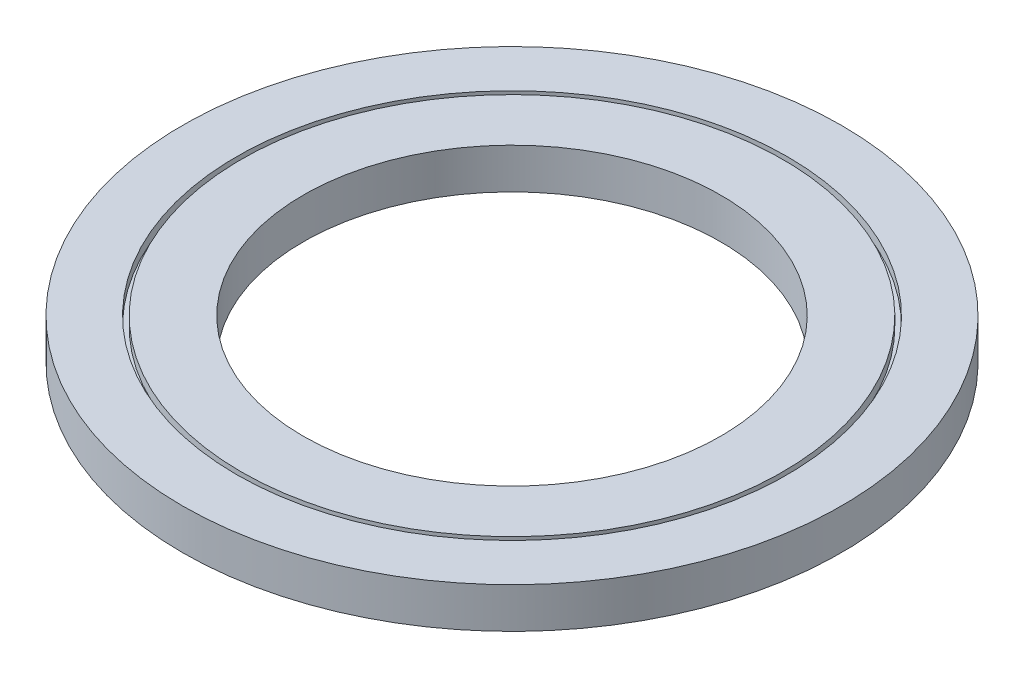
ISO-10303-21;
HEADER;
FILE_DESCRIPTION(('STEP AP214'),'2;1');
FILE_NAME('part.step','',(''),(''),'','','');
FILE_SCHEMA(('AUTOMOTIVE_DESIGN { 1 0 10303 214 1 1 1 1 }'));
ENDSEC;
DATA;
#1=APPLICATION_CONTEXT('core data for automotive mechanical design processes');
#2=APPLICATION_PROTOCOL_DEFINITION('international standard','automotive_design',2000,#1);
#3=PRODUCT_CONTEXT('',#1,'mechanical');
#4=PRODUCT('Part','Part','',(#3));
#5=PRODUCT_RELATED_PRODUCT_CATEGORY('part','',(#4));
#6=PRODUCT_DEFINITION_FORMATION('','',#4);
#7=PRODUCT_DEFINITION_CONTEXT('part definition',#1,'design');
#8=PRODUCT_DEFINITION('design','',#6,#7);
#9=PRODUCT_DEFINITION_SHAPE('','',#8);
#10=(LENGTH_UNIT() NAMED_UNIT(*) SI_UNIT(.MILLI.,.METRE.));
#11=(NAMED_UNIT(*) PLANE_ANGLE_UNIT() SI_UNIT($,.RADIAN.));
#12=(NAMED_UNIT(*) SI_UNIT($,.STERADIAN.) SOLID_ANGLE_UNIT());
#13=UNCERTAINTY_MEASURE_WITH_UNIT(LENGTH_MEASURE(1.E-05),#10,'distance_accuracy_value','');
#14=(GEOMETRIC_REPRESENTATION_CONTEXT(3) GLOBAL_UNCERTAINTY_ASSIGNED_CONTEXT((#13)) GLOBAL_UNIT_ASSIGNED_CONTEXT((#10,
#11,#12)) REPRESENTATION_CONTEXT('',''));
#15=CARTESIAN_POINT('',(0.,0.,0.));
#16=DIRECTION('',(0.,0.,1.));
#17=DIRECTION('',(1.,0.,0.));
#18=AXIS2_PLACEMENT_3D('',#15,#16,#17);
#19=CARTESIAN_POINT('',(0.,8.6,0.));
#20=DIRECTION('',(0.,1.,0.));
#21=DIRECTION('',(0.,0.,1.));
#22=AXIS2_PLACEMENT_3D('',#19,#20,#21);
#23=PLANE('',#22);
#24=CARTESIAN_POINT('',(0.,8.6,0.));
#25=DIRECTION('',(0.,1.,0.));
#26=DIRECTION('',(0.,0.,1.));
#27=AXIS2_PLACEMENT_3D('',#24,#25,#26);
#28=CIRCLE('',#27,44.35);
#29=CARTESIAN_POINT('',(0.,8.6,44.35));
#30=VERTEX_POINT('',#29);
#31=EDGE_CURVE('E56',#30,#30,#28,.T.);
#32=ORIENTED_EDGE('',*,*,#31,.F.);
#33=EDGE_LOOP('',(#32));
#34=FACE_BOUND('',#33,.T.);
#35=CARTESIAN_POINT('',(0.,8.6,0.));
#36=DIRECTION('',(0.,1.,0.));
#37=DIRECTION('',(0.,0.,1.));
#38=AXIS2_PLACEMENT_3D('',#35,#36,#37);
#39=CIRCLE('',#38,57.5);
#40=CARTESIAN_POINT('',(0.,8.6,57.5));
#41=VERTEX_POINT('',#40);
#42=EDGE_CURVE('E74',#41,#41,#39,.T.);
#43=ORIENTED_EDGE('',*,*,#42,.T.);
#44=EDGE_LOOP('',(#43));
#45=FACE_BOUND('',#44,.T.);
#46=ADVANCED_FACE('F43',(#34,#45),#23,.T.);
#47=CARTESIAN_POINT('',(0.,8.6,0.));
#48=DIRECTION('',(0.,1.,0.));
#49=DIRECTION('',(0.,0.,1.));
#50=AXIS2_PLACEMENT_3D('',#47,#48,#49);
#51=CIRCLE('',#50,58.5);
#52=CARTESIAN_POINT('',(0.,8.6,58.5));
#53=VERTEX_POINT('',#52);
#54=EDGE_CURVE('E66',#53,#53,#51,.T.);
#55=ORIENTED_EDGE('',*,*,#54,.F.);
#56=EDGE_LOOP('',(#55));
#57=FACE_BOUND('',#56,.T.);
#58=CARTESIAN_POINT('',(0.,8.6,0.));
#59=DIRECTION('',(0.,1.,0.));
#60=DIRECTION('',(0.,0.,1.));
#61=AXIS2_PLACEMENT_3D('',#58,#59,#60);
#62=CIRCLE('',#61,70.);
#63=CARTESIAN_POINT('',(0.,8.6,70.));
#64=VERTEX_POINT('',#63);
#65=EDGE_CURVE('E10',#64,#64,#62,.T.);
#66=ORIENTED_EDGE('',*,*,#65,.T.);
#67=EDGE_LOOP('',(#66));
#68=FACE_BOUND('',#67,.T.);
#69=ADVANCED_FACE('F98',(#57,#68),#23,.T.);
#70=CARTESIAN_POINT('',(0.,0.,0.));
#71=DIRECTION('',(0.,1.,0.));
#72=DIRECTION('',(0.,0.,1.));
#73=AXIS2_PLACEMENT_3D('',#70,#71,#72);
#74=PLANE('',#73);
#75=CARTESIAN_POINT('',(0.,0.,0.));
#76=DIRECTION('',(0.,1.,0.));
#77=DIRECTION('',(0.,0.,1.));
#78=AXIS2_PLACEMENT_3D('',#75,#76,#77);
#79=CIRCLE('',#78,70.);
#80=CARTESIAN_POINT('',(0.,0.,70.));
#81=VERTEX_POINT('',#80);
#82=EDGE_CURVE('E47',#81,#81,#79,.T.);
#83=ORIENTED_EDGE('',*,*,#82,.F.);
#84=EDGE_LOOP('',(#83));
#85=FACE_BOUND('',#84,.T.);
#86=CARTESIAN_POINT('',(0.,0.,0.));
#87=DIRECTION('',(0.,1.,0.));
#88=DIRECTION('',(0.,0.,1.));
#89=AXIS2_PLACEMENT_3D('',#86,#87,#88);
#90=CIRCLE('',#89,44.35);
#91=CARTESIAN_POINT('',(0.,0.,44.35));
#92=VERTEX_POINT('',#91);
#93=EDGE_CURVE('E58',#92,#92,#90,.T.);
#94=ORIENTED_EDGE('',*,*,#93,.T.);
#95=EDGE_LOOP('',(#94));
#96=FACE_BOUND('',#95,.T.);
#97=ADVANCED_FACE('F100',(#85,#96),#74,.F.);
#98=CARTESIAN_POINT('',(0.,8.6,0.));
#99=DIRECTION('',(0.,-1.,0.));
#100=DIRECTION('',(0.,0.,-1.));
#101=AXIS2_PLACEMENT_3D('',#98,#99,#100);
#102=CYLINDRICAL_SURFACE('',#101,70.);
#103=ORIENTED_EDGE('',*,*,#65,.F.);
#104=EDGE_LOOP('',(#103));
#105=FACE_BOUND('',#104,.T.);
#106=ORIENTED_EDGE('',*,*,#82,.T.);
#107=EDGE_LOOP('',(#106));
#108=FACE_BOUND('',#107,.T.);
#109=ADVANCED_FACE('F45',(#105,#108),#102,.T.);
#110=CARTESIAN_POINT('',(0.,8.6,0.));
#111=DIRECTION('',(0.,-1.,0.));
#112=DIRECTION('',(0.,0.,-1.));
#113=AXIS2_PLACEMENT_3D('',#110,#111,#112);
#114=CYLINDRICAL_SURFACE('',#113,44.35);
#115=ORIENTED_EDGE('',*,*,#31,.T.);
#116=EDGE_LOOP('',(#115));
#117=FACE_BOUND('',#116,.T.);
#118=ORIENTED_EDGE('',*,*,#93,.F.);
#119=EDGE_LOOP('',(#118));
#120=FACE_BOUND('',#119,.T.);
#121=ADVANCED_FACE('F94',(#117,#120),#114,.F.);
#122=CARTESIAN_POINT('',(0.,6.6,0.));
#123=DIRECTION('',(0.,1.,0.));
#124=DIRECTION('',(0.,0.,1.));
#125=AXIS2_PLACEMENT_3D('',#122,#123,#124);
#126=CYLINDRICAL_SURFACE('',#125,58.5);
#127=CARTESIAN_POINT('',(0.,6.6,0.));
#128=DIRECTION('',(0.,1.,0.));
#129=DIRECTION('',(0.,0.,1.));
#130=AXIS2_PLACEMENT_3D('',#127,#128,#129);
#131=CIRCLE('',#130,58.5);
#132=CARTESIAN_POINT('',(0.,6.6,58.5));
#133=VERTEX_POINT('',#132);
#134=EDGE_CURVE('E62',#133,#133,#131,.T.);
#135=ORIENTED_EDGE('',*,*,#134,.F.);
#136=EDGE_LOOP('',(#135));
#137=FACE_BOUND('',#136,.T.);
#138=ORIENTED_EDGE('',*,*,#54,.T.);
#139=EDGE_LOOP('',(#138));
#140=FACE_BOUND('',#139,.T.);
#141=ADVANCED_FACE('F88',(#137,#140),#126,.F.);
#142=CARTESIAN_POINT('',(0.,6.6,0.));
#143=DIRECTION('',(0.,1.,0.));
#144=DIRECTION('',(0.,0.,1.));
#145=AXIS2_PLACEMENT_3D('',#142,#143,#144);
#146=PLANE('',#145);
#147=CARTESIAN_POINT('',(0.,6.6,0.));
#148=DIRECTION('',(0.,1.,0.));
#149=DIRECTION('',(0.,0.,1.));
#150=AXIS2_PLACEMENT_3D('',#147,#148,#149);
#151=CIRCLE('',#150,57.5);
#152=CARTESIAN_POINT('',(0.,6.6,57.5));
#153=VERTEX_POINT('',#152);
#154=EDGE_CURVE('E70',#153,#153,#151,.T.);
#155=ORIENTED_EDGE('',*,*,#154,.F.);
#156=EDGE_LOOP('',(#155));
#157=FACE_BOUND('',#156,.T.);
#158=ORIENTED_EDGE('',*,*,#134,.T.);
#159=EDGE_LOOP('',(#158));
#160=FACE_BOUND('',#159,.T.);
#161=ADVANCED_FACE('F85',(#157,#160),#146,.T.);
#162=CARTESIAN_POINT('',(0.,6.6,0.));
#163=DIRECTION('',(0.,1.,0.));
#164=DIRECTION('',(0.,0.,1.));
#165=AXIS2_PLACEMENT_3D('',#162,#163,#164);
#166=CYLINDRICAL_SURFACE('',#165,57.5);
#167=ORIENTED_EDGE('',*,*,#154,.T.);
#168=EDGE_LOOP('',(#167));
#169=FACE_BOUND('',#168,.T.);
#170=ORIENTED_EDGE('',*,*,#42,.F.);
#171=EDGE_LOOP('',(#170));
#172=FACE_BOUND('',#171,.T.);
#173=ADVANCED_FACE('F82',(#169,#172),#166,.T.);
#174=CLOSED_SHELL('',(#46,#69,#97,#109,#121,#141,#161,#173));
#175=MANIFOLD_SOLID_BREP('B2',#174);
#176=ADVANCED_BREP_SHAPE_REPRESENTATION('',(#18,#175),#14);
#177=SHAPE_DEFINITION_REPRESENTATION(#9,#176);
ENDSEC;
END-ISO-10303-21;
